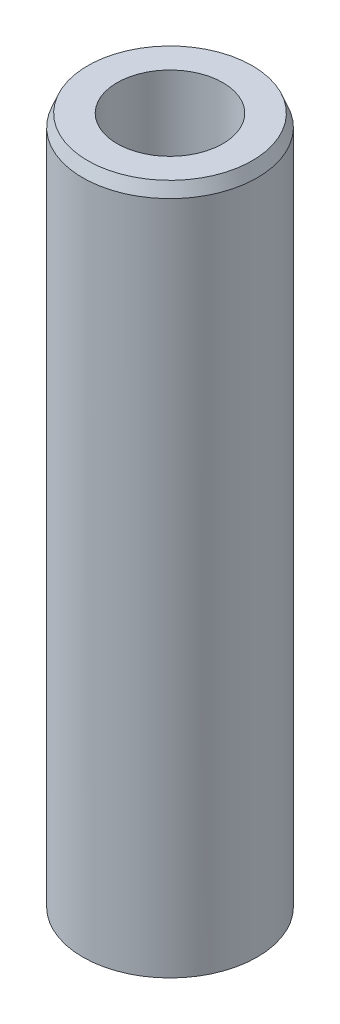
ISO-10303-21;
HEADER;
FILE_DESCRIPTION(('STEP AP214'),'2;1');
FILE_NAME('part.step','',(''),(''),'','','');
FILE_SCHEMA(('AUTOMOTIVE_DESIGN { 1 0 10303 214 1 1 1 1 }'));
ENDSEC;
DATA;
#1=APPLICATION_CONTEXT('core data for automotive mechanical design processes');
#2=APPLICATION_PROTOCOL_DEFINITION('international standard','automotive_design',2000,#1);
#3=PRODUCT_CONTEXT('',#1,'mechanical');
#4=PRODUCT('Part','Part','',(#3));
#5=PRODUCT_RELATED_PRODUCT_CATEGORY('part','',(#4));
#6=PRODUCT_DEFINITION_FORMATION('','',#4);
#7=PRODUCT_DEFINITION_CONTEXT('part definition',#1,'design');
#8=PRODUCT_DEFINITION('design','',#6,#7);
#9=PRODUCT_DEFINITION_SHAPE('','',#8);
#10=(LENGTH_UNIT() NAMED_UNIT(*) SI_UNIT(.MILLI.,.METRE.));
#11=(NAMED_UNIT(*) PLANE_ANGLE_UNIT() SI_UNIT($,.RADIAN.));
#12=(NAMED_UNIT(*) SI_UNIT($,.STERADIAN.) SOLID_ANGLE_UNIT());
#13=UNCERTAINTY_MEASURE_WITH_UNIT(LENGTH_MEASURE(1.E-05),#10,'distance_accuracy_value','');
#14=(GEOMETRIC_REPRESENTATION_CONTEXT(3) GLOBAL_UNCERTAINTY_ASSIGNED_CONTEXT((#13)) GLOBAL_UNIT_ASSIGNED_CONTEXT((#10,
#11,#12)) REPRESENTATION_CONTEXT('',''));
#15=CARTESIAN_POINT('',(0.,0.,0.));
#16=DIRECTION('',(0.,0.,1.));
#17=DIRECTION('',(1.,0.,0.));
#18=AXIS2_PLACEMENT_3D('',#15,#16,#17);
#19=CARTESIAN_POINT('',(0.,59.486597942146,0.));
#20=DIRECTION('',(0.,-1.,0.));
#21=DIRECTION('',(0.,0.,-1.));
#22=AXIS2_PLACEMENT_3D('',#19,#20,#21);
#23=CYLINDRICAL_SURFACE('',#22,7.5);
#24=CARTESIAN_POINT('',(0.,58.4260073126208,0.));
#25=DIRECTION('',(0.,1.,0.));
#26=DIRECTION('',(0.,0.,1.));
#27=AXIS2_PLACEMENT_3D('',#24,#25,#26);
#28=CIRCLE('',#27,7.5);
#29=CARTESIAN_POINT('',(0.,58.4260073126208,-7.5));
#30=VERTEX_POINT('',#29);
#31=EDGE_CURVE('E50',#30,#30,#28,.F.);
#32=CARTESIAN_POINT('',(0.,0.427700921327774,0.));
#33=DIRECTION('',(0.,1.,0.));
#34=DIRECTION('',(0.,0.,1.));
#35=AXIS2_PLACEMENT_3D('',#32,#33,#34);
#36=CIRCLE('',#35,7.5);
#37=CARTESIAN_POINT('',(0.,0.427700921327774,-7.5));
#38=VERTEX_POINT('',#37);
#39=EDGE_CURVE('E51',#38,#38,#36,.T.);
#40=CARTESIAN_POINT('',(0.,58.4260073126208,-7.5));
#41=CARTESIAN_POINT('',(0.,57.8218582877115,-7.5));
#42=CARTESIAN_POINT('',(0.,57.2177092628022,-7.5));
#43=CARTESIAN_POINT('',(0.,56.0094112129836,-7.5));
#44=CARTESIAN_POINT('',(0.,55.4052621880743,-7.5));
#45=CARTESIAN_POINT('',(0.,54.1969641382557,-7.5));
#46=CARTESIAN_POINT('',(0.,53.5928151133464,-7.5));
#47=CARTESIAN_POINT('',(0.,52.3845170635278,-7.5));
#48=CARTESIAN_POINT('',(0.,51.7803680386185,-7.5));
#49=CARTESIAN_POINT('',(0.,50.5720699887999,-7.5));
#50=CARTESIAN_POINT('',(0.,49.9679209638906,-7.5));
#51=CARTESIAN_POINT('',(0.,48.759622914072,-7.5));
#52=CARTESIAN_POINT('',(0.,48.1554738891627,-7.5));
#53=CARTESIAN_POINT('',(0.,46.9471758393441,-7.5));
#54=CARTESIAN_POINT('',(0.,46.3430268144348,-7.5));
#55=CARTESIAN_POINT('',(0.,45.1347287646162,-7.5));
#56=CARTESIAN_POINT('',(0.,44.5305797397069,-7.5));
#57=CARTESIAN_POINT('',(0.,43.3222816898882,-7.5));
#58=CARTESIAN_POINT('',(0.,42.7181326649789,-7.5));
#59=CARTESIAN_POINT('',(0.,41.5098346151603,-7.5));
#60=CARTESIAN_POINT('',(0.,40.905685590251,-7.5));
#61=CARTESIAN_POINT('',(0.,39.6973875404324,-7.5));
#62=CARTESIAN_POINT('',(0.,39.0932385155231,-7.5));
#63=CARTESIAN_POINT('',(0.,37.8849404657045,-7.5));
#64=CARTESIAN_POINT('',(0.,37.2807914407952,-7.5));
#65=CARTESIAN_POINT('',(0.,36.0724933909766,-7.5));
#66=CARTESIAN_POINT('',(0.,35.4683443660673,-7.5));
#67=CARTESIAN_POINT('',(0.,34.2600463162487,-7.5));
#68=CARTESIAN_POINT('',(0.,33.6558972913394,-7.5));
#69=CARTESIAN_POINT('',(0.,32.4475992415208,-7.5));
#70=CARTESIAN_POINT('',(0.,31.8434502166115,-7.5));
#71=CARTESIAN_POINT('',(0.,30.6351521667929,-7.5));
#72=CARTESIAN_POINT('',(0.,30.0310031418836,-7.5));
#73=CARTESIAN_POINT('',(0.,28.822705092065,-7.5));
#74=CARTESIAN_POINT('',(0.,28.2185560671557,-7.5));
#75=CARTESIAN_POINT('',(0.,27.0102580173371,-7.5));
#76=CARTESIAN_POINT('',(0.,26.4061089924278,-7.5));
#77=CARTESIAN_POINT('',(0.,25.1978109426092,-7.5));
#78=CARTESIAN_POINT('',(0.,24.5936619176999,-7.5));
#79=CARTESIAN_POINT('',(0.,23.3853638678813,-7.5));
#80=CARTESIAN_POINT('',(0.,22.781214842972,-7.5));
#81=CARTESIAN_POINT('',(0.,21.5729167931534,-7.5));
#82=CARTESIAN_POINT('',(0.,20.9687677682441,-7.5));
#83=CARTESIAN_POINT('',(0.,19.7604697184255,-7.5));
#84=CARTESIAN_POINT('',(0.,19.1563206935162,-7.5));
#85=CARTESIAN_POINT('',(0.,17.9480226436976,-7.5));
#86=CARTESIAN_POINT('',(0.,17.3438736187882,-7.5));
#87=CARTESIAN_POINT('',(0.,16.1355755689696,-7.5));
#88=CARTESIAN_POINT('',(0.,15.5314265440603,-7.5));
#89=CARTESIAN_POINT('',(0.,14.3231284942417,-7.5));
#90=CARTESIAN_POINT('',(0.,13.7189794693324,-7.5));
#91=CARTESIAN_POINT('',(0.,12.5106814195138,-7.5));
#92=CARTESIAN_POINT('',(0.,11.9065323946045,-7.5));
#93=CARTESIAN_POINT('',(0.,10.6982343447859,-7.5));
#94=CARTESIAN_POINT('',(0.,10.0940853198766,-7.5));
#95=CARTESIAN_POINT('',(0.,8.88578727005801,-7.5));
#96=CARTESIAN_POINT('',(0.,8.28163824514871,-7.5));
#97=CARTESIAN_POINT('',(0.,7.07334019533011,-7.5));
#98=CARTESIAN_POINT('',(0.,6.4691911704208,-7.5));
#99=CARTESIAN_POINT('',(0.,5.2608931206022,-7.5));
#100=CARTESIAN_POINT('',(0.,4.65674409569289,-7.5));
#101=CARTESIAN_POINT('',(0.,3.44844604587429,-7.5));
#102=CARTESIAN_POINT('',(0.,2.84429702096499,-7.5));
#103=CARTESIAN_POINT('',(0.,1.63599897114638,-7.5));
#104=CARTESIAN_POINT('',(0.,1.03184994623708,-7.5));
#105=CARTESIAN_POINT('',(0.,0.427700921327774,-7.5));
#106=B_SPLINE_CURVE_WITH_KNOTS('',3,(#40,#41,#42,#43,#44,#45,#46,#47,#48,#49,#50,#51,#52,#53,
#54,#55,#56,#57,#58,#59,#60,#61,#62,#63,#64,#65,#66,#67,#68,#69,#70,#71,#72,#73,#74,#75,#76,#77,
#78,#79,#80,#81,#82,#83,#84,#85,#86,#87,#88,#89,#90,#91,#92,#93,#94,#95,#96,#97,#98,#99,#100,
#101,#102,#103,#104,#105),.UNSPECIFIED.,.F.,.F.,(4,2,2,2,2,2,2,2,2,2,2,2,2,2,2,2,2,2,2,2,2,2,2,
2,2,2,2,2,2,2,2,2,4),(0.,1.81244707472791,3.62489414945582,5.43734122418373,7.24978829891163,
9.06223537363954,10.8746824483674,12.6871295230954,14.4995765978233,16.3120236725512,
18.1244707472791,19.936917822007,21.7493648967349,23.5618119714628,25.3742590461907,
27.1867061209186,28.9991531956465,30.8116002703744,32.6240473451023,34.4364944198302,
36.2489414945582,38.0613885692861,39.873835644014,41.6862827187419,43.4987297934698,
45.3111768681977,47.1236239429256,48.9360710176535,50.7485180923814,52.5609651671093,
54.3734122418372,56.1858593165651,57.998306391293),.UNSPECIFIED.);
#107=EDGE_CURVE('BSEAM39',#30,#38,#106,.T.);
#108=ORIENTED_EDGE('',*,*,#31,.T.);
#109=ORIENTED_EDGE('',*,*,#39,.T.);
#110=ORIENTED_EDGE('',*,*,#107,.T.);
#111=ORIENTED_EDGE('',*,*,#107,.F.);
#112=EDGE_LOOP('',(#108,#110,#109,#111));
#113=FACE_BOUND('',#112,.T.);
#114=ADVANCED_FACE('F39',(#113),#23,.T.);
#115=CARTESIAN_POINT('',(0.,59.486597942146,0.));
#116=DIRECTION('',(0.,1.,0.));
#117=DIRECTION('',(0.,0.,1.));
#118=AXIS2_PLACEMENT_3D('',#115,#116,#117);
#119=PLANE('',#118);
#120=CARTESIAN_POINT('',(0.,59.486597942146,0.));
#121=DIRECTION('',(0.,1.,0.));
#122=DIRECTION('',(0.,0.,1.));
#123=AXIS2_PLACEMENT_3D('',#120,#121,#122);
#124=CIRCLE('',#123,7.07229907867227);
#125=CARTESIAN_POINT('',(0.,59.486597942146,7.07229907867227));
#126=VERTEX_POINT('',#125);
#127=EDGE_CURVE('E54',#126,#126,#124,.T.);
#128=ORIENTED_EDGE('',*,*,#127,.T.);
#129=EDGE_LOOP('',(#128));
#130=FACE_BOUND('',#129,.T.);
#131=CARTESIAN_POINT('',(0.,59.486597942146,0.));
#132=DIRECTION('',(0.,1.,0.));
#133=DIRECTION('',(0.,0.,1.));
#134=AXIS2_PLACEMENT_3D('',#131,#132,#133);
#135=CIRCLE('',#134,4.54667379622355);
#136=CARTESIAN_POINT('',(0.,59.486597942146,-4.54667379622355));
#137=VERTEX_POINT('',#136);
#138=EDGE_CURVE('E58',#137,#137,#135,.T.);
#139=ORIENTED_EDGE('',*,*,#138,.F.);
#140=EDGE_LOOP('',(#139));
#141=FACE_BOUND('',#140,.T.);
#142=ADVANCED_FACE('F69',(#130,#141),#119,.T.);
#143=CARTESIAN_POINT('',(0.,0.,0.));
#144=DIRECTION('',(0.,1.,0.));
#145=DIRECTION('',(0.,0.,1.));
#146=AXIS2_PLACEMENT_3D('',#143,#144,#145);
#147=PLANE('',#146);
#148=CARTESIAN_POINT('',(0.,0.,0.));
#149=DIRECTION('',(0.,1.,0.));
#150=DIRECTION('',(0.,0.,1.));
#151=AXIS2_PLACEMENT_3D('',#148,#149,#150);
#152=CIRCLE('',#151,6.43940937047465);
#153=CARTESIAN_POINT('',(0.,0.,6.43940937047465));
#154=VERTEX_POINT('',#153);
#155=EDGE_CURVE('E10',#154,#154,#152,.F.);
#156=ORIENTED_EDGE('',*,*,#155,.T.);
#157=EDGE_LOOP('',(#156));
#158=FACE_BOUND('',#157,.T.);
#159=CARTESIAN_POINT('',(0.,0.,0.));
#160=DIRECTION('',(0.,1.,0.));
#161=DIRECTION('',(0.,0.,1.));
#162=AXIS2_PLACEMENT_3D('',#159,#160,#161);
#163=CIRCLE('',#162,4.54667379622355);
#164=CARTESIAN_POINT('',(0.,0.,-4.54667379622355));
#165=VERTEX_POINT('',#164);
#166=EDGE_CURVE('E63',#165,#165,#163,.T.);
#167=ORIENTED_EDGE('',*,*,#166,.T.);
#168=EDGE_LOOP('',(#167));
#169=FACE_BOUND('',#168,.T.);
#170=ADVANCED_FACE('F75',(#158,#169),#147,.F.);
#171=CARTESIAN_POINT('',(0.,59.486597942146,0.));
#172=DIRECTION('',(0.,-1.,0.));
#173=DIRECTION('',(0.,0.,-1.));
#174=AXIS2_PLACEMENT_3D('',#171,#172,#173);
#175=CYLINDRICAL_SURFACE('',#174,4.54667379622355);
#176=CARTESIAN_POINT('',(0.,59.486597942146,-4.54667379622355));
#177=CARTESIAN_POINT('',(0.,58.8669458802487,-4.54667379622355));
#178=CARTESIAN_POINT('',(0.,58.2472938183513,-4.54667379622355));
#179=CARTESIAN_POINT('',(0.,57.0079896945566,-4.54667379622355));
#180=CARTESIAN_POINT('',(0.,56.3883376326593,-4.54667379622355));
#181=CARTESIAN_POINT('',(0.,55.1490335088646,-4.54667379622355));
#182=CARTESIAN_POINT('',(0.,54.5293814469672,-4.54667379622355));
#183=CARTESIAN_POINT('',(0.,53.2900773231725,-4.54667379622355));
#184=CARTESIAN_POINT('',(0.,52.6704252612751,-4.54667379622355));
#185=CARTESIAN_POINT('',(0.,51.4311211374804,-4.54667379622355));
#186=CARTESIAN_POINT('',(0.,50.8114690755831,-4.54667379622355));
#187=CARTESIAN_POINT('',(0.,49.5721649517884,-4.54667379622355));
#188=CARTESIAN_POINT('',(0.,48.952512889891,-4.54667379622355));
#189=CARTESIAN_POINT('',(0.,47.7132087660963,-4.54667379622355));
#190=CARTESIAN_POINT('',(0.,47.0935567041989,-4.54667379622355));
#191=CARTESIAN_POINT('',(0.,45.8542525804042,-4.54667379622355));
#192=CARTESIAN_POINT('',(0.,45.2346005185069,-4.54667379622355));
#193=CARTESIAN_POINT('',(0.,43.9952963947122,-4.54667379622355));
#194=CARTESIAN_POINT('',(0.,43.3756443328148,-4.54667379622355));
#195=CARTESIAN_POINT('',(0.,42.1363402090201,-4.54667379622355));
#196=CARTESIAN_POINT('',(0.,41.5166881471228,-4.54667379622355));
#197=CARTESIAN_POINT('',(0.,40.277384023328,-4.54667379622355));
#198=CARTESIAN_POINT('',(0.,39.6577319614307,-4.54667379622355));
#199=CARTESIAN_POINT('',(0.,38.418427837636,-4.54667379622355));
#200=CARTESIAN_POINT('',(0.,37.7987757757386,-4.54667379622355));
#201=CARTESIAN_POINT('',(0.,36.5594716519439,-4.54667379622355));
#202=CARTESIAN_POINT('',(0.,35.9398195900466,-4.54667379622355));
#203=CARTESIAN_POINT('',(0.,34.7005154662519,-4.54667379622355));
#204=CARTESIAN_POINT('',(0.,34.0808634043545,-4.54667379622355));
#205=CARTESIAN_POINT('',(0.,32.8415592805598,-4.54667379622355));
#206=CARTESIAN_POINT('',(0.,32.2219072186624,-4.54667379622355));
#207=CARTESIAN_POINT('',(0.,30.9826030948677,-4.54667379622355));
#208=CARTESIAN_POINT('',(0.,30.3629510329704,-4.54667379622355));
#209=CARTESIAN_POINT('',(0.,29.1236469091757,-4.54667379622355));
#210=CARTESIAN_POINT('',(0.,28.5039948472783,-4.54667379622355));
#211=CARTESIAN_POINT('',(0.,27.2646907234836,-4.54667379622355));
#212=CARTESIAN_POINT('',(0.,26.6450386615862,-4.54667379622355));
#213=CARTESIAN_POINT('',(0.,25.4057345377915,-4.54667379622355));
#214=CARTESIAN_POINT('',(0.,24.7860824758942,-4.54667379622355));
#215=CARTESIAN_POINT('',(0.,23.5467783520995,-4.54667379622355));
#216=CARTESIAN_POINT('',(0.,22.9271262902021,-4.54667379622355));
#217=CARTESIAN_POINT('',(0.,21.6878221664074,-4.54667379622355));
#218=CARTESIAN_POINT('',(0.,21.0681701045101,-4.54667379622355));
#219=CARTESIAN_POINT('',(0.,19.8288659807153,-4.54667379622355));
#220=CARTESIAN_POINT('',(0.,19.209213918818,-4.54667379622355));
#221=CARTESIAN_POINT('',(0.,17.9699097950233,-4.54667379622355));
#222=CARTESIAN_POINT('',(0.,17.3502577331259,-4.54667379622355));
#223=CARTESIAN_POINT('',(0.,16.1109536093312,-4.54667379622355));
#224=CARTESIAN_POINT('',(0.,15.4913015474339,-4.54667379622355));
#225=CARTESIAN_POINT('',(0.,14.2519974236392,-4.54667379622355));
#226=CARTESIAN_POINT('',(0.,13.6323453617418,-4.54667379622355));
#227=CARTESIAN_POINT('',(0.,12.3930412379471,-4.54667379622355));
#228=CARTESIAN_POINT('',(0.,11.7733891760497,-4.54667379622355));
#229=CARTESIAN_POINT('',(0.,10.534085052255,-4.54667379622355));
#230=CARTESIAN_POINT('',(0.,9.91443299035767,-4.54667379622355));
#231=CARTESIAN_POINT('',(0.,8.67512886656296,-4.54667379622355));
#232=CARTESIAN_POINT('',(0.,8.05547680466561,-4.54667379622355));
#233=CARTESIAN_POINT('',(0.,6.81617268087089,-4.54667379622355));
#234=CARTESIAN_POINT('',(0.,6.19652061897354,-4.54667379622355));
#235=CARTESIAN_POINT('',(0.,4.95721649517883,-4.54667379622355));
#236=CARTESIAN_POINT('',(0.,4.33756443328148,-4.54667379622355));
#237=CARTESIAN_POINT('',(0.,3.09826030948677,-4.54667379622355));
#238=CARTESIAN_POINT('',(0.,2.47860824758941,-4.54667379622355));
#239=CARTESIAN_POINT('',(0.,1.23930412379471,-4.54667379622355));
#240=CARTESIAN_POINT('',(0.,0.619652061897349,-4.54667379622355));
#241=CARTESIAN_POINT('',(0.,0.,-4.54667379622355));
#242=B_SPLINE_CURVE_WITH_KNOTS('',3,(#176,#177,#178,#179,#180,#181,#182,#183,#184,#185,#186,
#187,#188,#189,#190,#191,#192,#193,#194,#195,#196,#197,#198,#199,#200,#201,#202,#203,#204,#205,
#206,#207,#208,#209,#210,#211,#212,#213,#214,#215,#216,#217,#218,#219,#220,#221,#222,#223,#224,
#225,#226,#227,#228,#229,#230,#231,#232,#233,#234,#235,#236,#237,#238,#239,#240,#241),
.UNSPECIFIED.,.F.,.F.,(4,2,2,2,2,2,2,2,2,2,2,2,2,2,2,2,2,2,2,2,2,2,2,2,2,2,2,2,2,2,2,2,4),(0.,
1.85895618569207,3.71791237138413,5.5768685570762,7.43582474276826,9.29478092846032,
11.1537371141524,13.0126932998445,14.8716494855365,16.7306056712286,18.5895618569206,
20.4485180426127,22.3074742283048,24.1664304139968,26.0253865996889,27.884342785381,
29.743298971073,31.6022551567651,33.4612113424571,35.3201675281492,37.1791237138413,
39.0380798995333,40.8970360852254,42.7559922709175,44.6149484566095,46.4739046423016,
48.3328608279937,50.1918170136857,52.0507731993778,53.9097293850699,55.7686855707619,
57.627641756454,59.486597942146),.UNSPECIFIED.);
#243=EDGE_CURVE('BSEAM70',#137,#165,#242,.T.);
#244=ORIENTED_EDGE('',*,*,#138,.T.);
#245=ORIENTED_EDGE('',*,*,#166,.F.);
#246=ORIENTED_EDGE('',*,*,#243,.T.);
#247=ORIENTED_EDGE('',*,*,#243,.F.);
#248=EDGE_LOOP('',(#244,#246,#245,#247));
#249=FACE_BOUND('',#248,.T.);
#250=ADVANCED_FACE('F70',(#249),#175,.F.);
#251=CARTESIAN_POINT('',(0.,59.486597942146,0.));
#252=DIRECTION('',(0.,-1.,0.));
#253=DIRECTION('',(0.,0.,-1.));
#254=AXIS2_PLACEMENT_3D('',#251,#252,#253);
#255=CONICAL_SURFACE('',#254,7.07229907867227,0.383319352642883);
#256=ORIENTED_EDGE('',*,*,#31,.F.);
#257=EDGE_LOOP('',(#256));
#258=FACE_BOUND('',#257,.T.);
#259=ORIENTED_EDGE('',*,*,#127,.F.);
#260=EDGE_LOOP('',(#259));
#261=FACE_BOUND('',#260,.T.);
#262=ADVANCED_FACE('F81',(#258,#261),#255,.T.);
#263=CARTESIAN_POINT('',(0.,0.427700921327774,0.));
#264=DIRECTION('',(0.,1.,0.));
#265=DIRECTION('',(0.,0.,1.));
#266=AXIS2_PLACEMENT_3D('',#263,#264,#265);
#267=CONICAL_SURFACE('',#266,7.5,1.18747697415201);
#268=ORIENTED_EDGE('',*,*,#155,.F.);
#269=EDGE_LOOP('',(#268));
#270=FACE_BOUND('',#269,.T.);
#271=ORIENTED_EDGE('',*,*,#39,.F.);
#272=EDGE_LOOP('',(#271));
#273=FACE_BOUND('',#272,.T.);
#274=ADVANCED_FACE('F45',(#270,#273),#267,.T.);
#275=CLOSED_SHELL('',(#114,#142,#170,#250,#262,#274));
#276=MANIFOLD_SOLID_BREP('B2',#275);
#277=ADVANCED_BREP_SHAPE_REPRESENTATION('',(#18,#276),#14);
#278=SHAPE_DEFINITION_REPRESENTATION(#9,#277);
ENDSEC;
END-ISO-10303-21;
